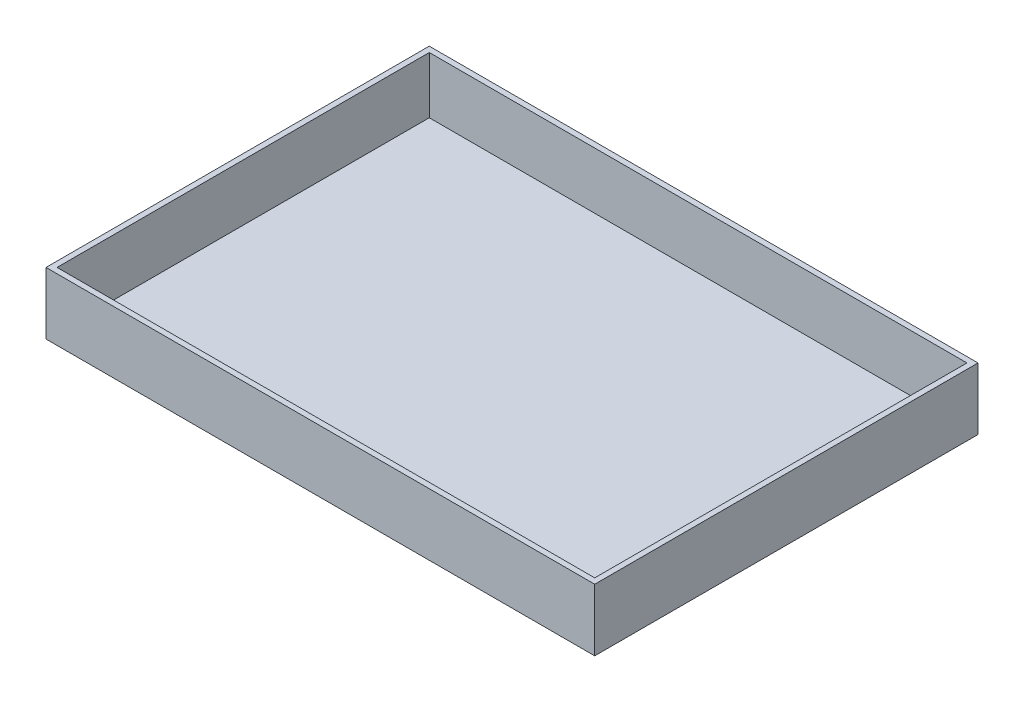
ISO-10303-21;
HEADER;
FILE_DESCRIPTION(('STEP AP214'),'2;1');
FILE_NAME('part.step','',(''),(''),'','','');
FILE_SCHEMA(('AUTOMOTIVE_DESIGN { 1 0 10303 214 1 1 1 1 }'));
ENDSEC;
DATA;
#1=APPLICATION_CONTEXT('core data for automotive mechanical design processes');
#2=APPLICATION_PROTOCOL_DEFINITION('international standard','automotive_design',2000,#1);
#3=PRODUCT_CONTEXT('',#1,'mechanical');
#4=PRODUCT('Part','Part','',(#3));
#5=PRODUCT_RELATED_PRODUCT_CATEGORY('part','',(#4));
#6=PRODUCT_DEFINITION_FORMATION('','',#4);
#7=PRODUCT_DEFINITION_CONTEXT('part definition',#1,'design');
#8=PRODUCT_DEFINITION('design','',#6,#7);
#9=PRODUCT_DEFINITION_SHAPE('','',#8);
#10=(LENGTH_UNIT() NAMED_UNIT(*) SI_UNIT(.MILLI.,.METRE.));
#11=(NAMED_UNIT(*) PLANE_ANGLE_UNIT() SI_UNIT($,.RADIAN.));
#12=(NAMED_UNIT(*) SI_UNIT($,.STERADIAN.) SOLID_ANGLE_UNIT());
#13=UNCERTAINTY_MEASURE_WITH_UNIT(LENGTH_MEASURE(1.E-05),#10,'distance_accuracy_value','');
#14=(GEOMETRIC_REPRESENTATION_CONTEXT(3) GLOBAL_UNCERTAINTY_ASSIGNED_CONTEXT((#13)) GLOBAL_UNIT_ASSIGNED_CONTEXT((#10,
#11,#12)) REPRESENTATION_CONTEXT('',''));
#15=CARTESIAN_POINT('',(0.,0.,0.));
#16=DIRECTION('',(0.,0.,1.));
#17=DIRECTION('',(1.,0.,0.));
#18=AXIS2_PLACEMENT_3D('',#15,#16,#17);
#19=CARTESIAN_POINT('',(0.,28.575,0.));
#20=DIRECTION('',(1.,0.,0.));
#21=DIRECTION('',(0.,0.,-1.));
#22=AXIS2_PLACEMENT_3D('',#19,#20,#21);
#23=PLANE('',#22);
#24=DIRECTION('',(0.,0.,1.));
#25=VECTOR('',#24,1.);
#26=CARTESIAN_POINT('',(0.,0.,0.));
#27=LINE('',#26,#25);
#28=CARTESIAN_POINT('',(0.,0.,0.));
#29=VERTEX_POINT('',#28);
#30=CARTESIAN_POINT('',(0.,0.,176.53));
#31=VERTEX_POINT('',#30);
#32=EDGE_CURVE('E150',#29,#31,#27,.T.);
#33=ORIENTED_EDGE('',*,*,#32,.T.);
#34=DIRECTION('',(0.,-1.,0.));
#35=VECTOR('',#34,1.);
#36=CARTESIAN_POINT('',(0.,28.575,176.53));
#37=LINE('',#36,#35);
#38=CARTESIAN_POINT('',(0.,28.575,176.53));
#39=VERTEX_POINT('',#38);
#40=EDGE_CURVE('E11',#39,#31,#37,.T.);
#41=ORIENTED_EDGE('',*,*,#40,.F.);
#42=DIRECTION('',(0.,0.,1.));
#43=VECTOR('',#42,1.);
#44=CARTESIAN_POINT('',(0.,28.575,0.));
#45=LINE('',#44,#43);
#46=CARTESIAN_POINT('',(0.,28.575,0.));
#47=VERTEX_POINT('',#46);
#48=EDGE_CURVE('E143',#47,#39,#45,.T.);
#49=ORIENTED_EDGE('',*,*,#48,.F.);
#50=DIRECTION('',(0.,-1.,0.));
#51=VECTOR('',#50,1.);
#52=CARTESIAN_POINT('',(0.,28.575,0.));
#53=LINE('',#52,#51);
#54=EDGE_CURVE('E149',#47,#29,#53,.T.);
#55=ORIENTED_EDGE('',*,*,#54,.T.);
#56=EDGE_LOOP('',(#33,#41,#49,#55));
#57=FACE_BOUND('',#56,.T.);
#58=ADVANCED_FACE('F36',(#57),#23,.F.);
#59=CARTESIAN_POINT('',(0.,28.575,176.53));
#60=DIRECTION('',(0.,0.,-1.));
#61=DIRECTION('',(-1.,0.,0.));
#62=AXIS2_PLACEMENT_3D('',#59,#60,#61);
#63=PLANE('',#62);
#64=DIRECTION('',(1.,0.,0.));
#65=VECTOR('',#64,1.);
#66=CARTESIAN_POINT('',(0.,0.,176.53));
#67=LINE('',#66,#65);
#68=CARTESIAN_POINT('',(252.73,0.,176.53));
#69=VERTEX_POINT('',#68);
#70=EDGE_CURVE('E153',#31,#69,#67,.T.);
#71=ORIENTED_EDGE('',*,*,#70,.T.);
#72=DIRECTION('',(0.,-1.,0.));
#73=VECTOR('',#72,1.);
#74=CARTESIAN_POINT('',(252.73,28.575,176.53));
#75=LINE('',#74,#73);
#76=CARTESIAN_POINT('',(252.73,28.575,176.53));
#77=VERTEX_POINT('',#76);
#78=EDGE_CURVE('E43',#77,#69,#75,.T.);
#79=ORIENTED_EDGE('',*,*,#78,.F.);
#80=DIRECTION('',(1.,0.,0.));
#81=VECTOR('',#80,1.);
#82=CARTESIAN_POINT('',(0.,28.575,176.53));
#83=LINE('',#82,#81);
#84=EDGE_CURVE('E87',#39,#77,#83,.T.);
#85=ORIENTED_EDGE('',*,*,#84,.F.);
#86=ORIENTED_EDGE('',*,*,#40,.T.);
#87=EDGE_LOOP('',(#71,#79,#85,#86));
#88=FACE_BOUND('',#87,.T.);
#89=ADVANCED_FACE('F182',(#88),#63,.F.);
#90=CARTESIAN_POINT('',(252.73,28.575,0.));
#91=DIRECTION('',(-1.,0.,0.));
#92=DIRECTION('',(0.,0.,1.));
#93=AXIS2_PLACEMENT_3D('',#90,#91,#92);
#94=PLANE('',#93);
#95=DIRECTION('',(0.,0.,-1.));
#96=VECTOR('',#95,1.);
#97=CARTESIAN_POINT('',(252.73,0.,0.));
#98=LINE('',#97,#96);
#99=CARTESIAN_POINT('',(252.73,0.,0.));
#100=VERTEX_POINT('',#99);
#101=EDGE_CURVE('E155',#69,#100,#98,.T.);
#102=ORIENTED_EDGE('',*,*,#101,.T.);
#103=DIRECTION('',(0.,-1.,0.));
#104=VECTOR('',#103,1.);
#105=CARTESIAN_POINT('',(252.73,28.575,0.));
#106=LINE('',#105,#104);
#107=CARTESIAN_POINT('',(252.73,28.575,0.));
#108=VERTEX_POINT('',#107);
#109=EDGE_CURVE('E159',#108,#100,#106,.T.);
#110=ORIENTED_EDGE('',*,*,#109,.F.);
#111=DIRECTION('',(0.,0.,-1.));
#112=VECTOR('',#111,1.);
#113=CARTESIAN_POINT('',(252.73,28.575,0.));
#114=LINE('',#113,#112);
#115=EDGE_CURVE('E146',#77,#108,#114,.T.);
#116=ORIENTED_EDGE('',*,*,#115,.F.);
#117=ORIENTED_EDGE('',*,*,#78,.T.);
#118=EDGE_LOOP('',(#102,#110,#116,#117));
#119=FACE_BOUND('',#118,.T.);
#120=ADVANCED_FACE('F164',(#119),#94,.F.);
#121=CARTESIAN_POINT('',(0.,28.575,0.));
#122=DIRECTION('',(0.,0.,1.));
#123=DIRECTION('',(1.,0.,0.));
#124=AXIS2_PLACEMENT_3D('',#121,#122,#123);
#125=PLANE('',#124);
#126=DIRECTION('',(-1.,0.,0.));
#127=VECTOR('',#126,1.);
#128=CARTESIAN_POINT('',(0.,0.,0.));
#129=LINE('',#128,#127);
#130=EDGE_CURVE('E80',#100,#29,#129,.T.);
#131=ORIENTED_EDGE('',*,*,#130,.T.);
#132=ORIENTED_EDGE('',*,*,#54,.F.);
#133=DIRECTION('',(-1.,0.,0.));
#134=VECTOR('',#133,1.);
#135=CARTESIAN_POINT('',(0.,28.575,0.));
#136=LINE('',#135,#134);
#137=EDGE_CURVE('E59',#108,#47,#136,.T.);
#138=ORIENTED_EDGE('',*,*,#137,.F.);
#139=ORIENTED_EDGE('',*,*,#109,.T.);
#140=EDGE_LOOP('',(#131,#132,#138,#139));
#141=FACE_BOUND('',#140,.T.);
#142=ADVANCED_FACE('F172',(#141),#125,.F.);
#143=CARTESIAN_POINT('',(0.,28.575,0.));
#144=DIRECTION('',(0.,1.,0.));
#145=DIRECTION('',(0.,0.,1.));
#146=AXIS2_PLACEMENT_3D('',#143,#144,#145);
#147=PLANE('',#146);
#148=DIRECTION('',(0.,0.,1.));
#149=VECTOR('',#148,1.);
#150=CARTESIAN_POINT('',(2.54,28.575,0.));
#151=LINE('',#150,#149);
#152=CARTESIAN_POINT('',(2.54,28.575,2.54));
#153=VERTEX_POINT('',#152);
#154=CARTESIAN_POINT('',(2.54000000000002,28.575,173.99));
#155=VERTEX_POINT('',#154);
#156=EDGE_CURVE('E132',#153,#155,#151,.T.);
#157=ORIENTED_EDGE('',*,*,#156,.F.);
#158=DIRECTION('',(-1.,0.,0.));
#159=VECTOR('',#158,1.);
#160=CARTESIAN_POINT('',(0.,28.575,2.54));
#161=LINE('',#160,#159);
#162=CARTESIAN_POINT('',(250.19,28.575,2.54));
#163=VERTEX_POINT('',#162);
#164=EDGE_CURVE('E141',#163,#153,#161,.T.);
#165=ORIENTED_EDGE('',*,*,#164,.F.);
#166=DIRECTION('',(0.,0.,-1.));
#167=VECTOR('',#166,1.);
#168=CARTESIAN_POINT('',(250.19,28.575,0.));
#169=LINE('',#168,#167);
#170=CARTESIAN_POINT('',(250.19,28.575,173.99));
#171=VERTEX_POINT('',#170);
#172=EDGE_CURVE('E139',#171,#163,#169,.T.);
#173=ORIENTED_EDGE('',*,*,#172,.F.);
#174=DIRECTION('',(1.,0.,0.));
#175=VECTOR('',#174,1.);
#176=CARTESIAN_POINT('',(0.,28.575,173.99));
#177=LINE('',#176,#175);
#178=EDGE_CURVE('E124',#155,#171,#177,.T.);
#179=ORIENTED_EDGE('',*,*,#178,.F.);
#180=EDGE_LOOP('',(#157,#165,#173,#179));
#181=FACE_BOUND('',#180,.T.);
#182=ORIENTED_EDGE('',*,*,#48,.T.);
#183=ORIENTED_EDGE('',*,*,#84,.T.);
#184=ORIENTED_EDGE('',*,*,#115,.T.);
#185=ORIENTED_EDGE('',*,*,#137,.T.);
#186=EDGE_LOOP('',(#182,#183,#184,#185));
#187=FACE_BOUND('',#186,.T.);
#188=ADVANCED_FACE('F174',(#181,#187),#147,.T.);
#189=CARTESIAN_POINT('',(0.,0.,0.));
#190=DIRECTION('',(0.,1.,0.));
#191=DIRECTION('',(0.,0.,1.));
#192=AXIS2_PLACEMENT_3D('',#189,#190,#191);
#193=PLANE('',#192);
#194=ORIENTED_EDGE('',*,*,#32,.F.);
#195=ORIENTED_EDGE('',*,*,#130,.F.);
#196=ORIENTED_EDGE('',*,*,#101,.F.);
#197=ORIENTED_EDGE('',*,*,#70,.F.);
#198=EDGE_LOOP('',(#194,#195,#196,#197));
#199=FACE_BOUND('',#198,.T.);
#200=ADVANCED_FACE('F168',(#199),#193,.F.);
#201=CARTESIAN_POINT('',(2.54,28.575,0.));
#202=DIRECTION('',(1.,0.,0.));
#203=DIRECTION('',(0.,0.,-1.));
#204=AXIS2_PLACEMENT_3D('',#201,#202,#203);
#205=PLANE('',#204);
#206=DIRECTION('',(0.,0.,1.));
#207=VECTOR('',#206,1.);
#208=CARTESIAN_POINT('',(2.54,2.54,0.));
#209=LINE('',#208,#207);
#210=CARTESIAN_POINT('',(2.54,2.54,2.54));
#211=VERTEX_POINT('',#210);
#212=CARTESIAN_POINT('',(2.54000000000002,2.54,173.99));
#213=VERTEX_POINT('',#212);
#214=EDGE_CURVE('E115',#211,#213,#209,.T.);
#215=ORIENTED_EDGE('',*,*,#214,.F.);
#216=DIRECTION('',(0.,-1.,0.));
#217=VECTOR('',#216,1.);
#218=CARTESIAN_POINT('',(2.54,28.575,2.54));
#219=LINE('',#218,#217);
#220=EDGE_CURVE('E135',#153,#211,#219,.T.);
#221=ORIENTED_EDGE('',*,*,#220,.F.);
#222=ORIENTED_EDGE('',*,*,#156,.T.);
#223=DIRECTION('',(0.,-1.,0.));
#224=VECTOR('',#223,1.);
#225=CARTESIAN_POINT('',(2.54000000000002,28.575,173.99));
#226=LINE('',#225,#224);
#227=EDGE_CURVE('E127',#155,#213,#226,.T.);
#228=ORIENTED_EDGE('',*,*,#227,.T.);
#229=EDGE_LOOP('',(#215,#221,#222,#228));
#230=FACE_BOUND('',#229,.T.);
#231=ADVANCED_FACE('F209',(#230),#205,.T.);
#232=CARTESIAN_POINT('',(0.,28.575,173.99));
#233=DIRECTION('',(0.,0.,-1.));
#234=DIRECTION('',(-1.,0.,0.));
#235=AXIS2_PLACEMENT_3D('',#232,#233,#234);
#236=PLANE('',#235);
#237=DIRECTION('',(1.,0.,0.));
#238=VECTOR('',#237,1.);
#239=CARTESIAN_POINT('',(0.,2.54,173.99));
#240=LINE('',#239,#238);
#241=CARTESIAN_POINT('',(250.19,2.54,173.99));
#242=VERTEX_POINT('',#241);
#243=EDGE_CURVE('E109',#213,#242,#240,.T.);
#244=ORIENTED_EDGE('',*,*,#243,.F.);
#245=ORIENTED_EDGE('',*,*,#227,.F.);
#246=ORIENTED_EDGE('',*,*,#178,.T.);
#247=DIRECTION('',(0.,-1.,0.));
#248=VECTOR('',#247,1.);
#249=CARTESIAN_POINT('',(250.19,28.575,173.99));
#250=LINE('',#249,#248);
#251=EDGE_CURVE('E121',#171,#242,#250,.T.);
#252=ORIENTED_EDGE('',*,*,#251,.T.);
#253=EDGE_LOOP('',(#244,#245,#246,#252));
#254=FACE_BOUND('',#253,.T.);
#255=ADVANCED_FACE('F122',(#254),#236,.T.);
#256=CARTESIAN_POINT('',(250.19,28.575,0.));
#257=DIRECTION('',(-1.,0.,0.));
#258=DIRECTION('',(0.,0.,1.));
#259=AXIS2_PLACEMENT_3D('',#256,#257,#258);
#260=PLANE('',#259);
#261=DIRECTION('',(0.,0.,-1.));
#262=VECTOR('',#261,1.);
#263=CARTESIAN_POINT('',(250.19,2.54,0.));
#264=LINE('',#263,#262);
#265=CARTESIAN_POINT('',(250.19,2.54,2.54));
#266=VERTEX_POINT('',#265);
#267=EDGE_CURVE('E113',#242,#266,#264,.T.);
#268=ORIENTED_EDGE('',*,*,#267,.F.);
#269=ORIENTED_EDGE('',*,*,#251,.F.);
#270=ORIENTED_EDGE('',*,*,#172,.T.);
#271=DIRECTION('',(0.,-1.,0.));
#272=VECTOR('',#271,1.);
#273=CARTESIAN_POINT('',(250.19,28.575,2.54));
#274=LINE('',#273,#272);
#275=EDGE_CURVE('E50',#163,#266,#274,.T.);
#276=ORIENTED_EDGE('',*,*,#275,.T.);
#277=EDGE_LOOP('',(#268,#269,#270,#276));
#278=FACE_BOUND('',#277,.T.);
#279=ADVANCED_FACE('F129',(#278),#260,.T.);
#280=CARTESIAN_POINT('',(0.,28.575,2.54));
#281=DIRECTION('',(0.,0.,1.));
#282=DIRECTION('',(1.,0.,0.));
#283=AXIS2_PLACEMENT_3D('',#280,#281,#282);
#284=PLANE('',#283);
#285=DIRECTION('',(-1.,0.,0.));
#286=VECTOR('',#285,1.);
#287=CARTESIAN_POINT('',(0.,2.54,2.54));
#288=LINE('',#287,#286);
#289=EDGE_CURVE('E130',#266,#211,#288,.T.);
#290=ORIENTED_EDGE('',*,*,#289,.F.);
#291=ORIENTED_EDGE('',*,*,#275,.F.);
#292=ORIENTED_EDGE('',*,*,#164,.T.);
#293=ORIENTED_EDGE('',*,*,#220,.T.);
#294=EDGE_LOOP('',(#290,#291,#292,#293));
#295=FACE_BOUND('',#294,.T.);
#296=ADVANCED_FACE('F239',(#295),#284,.T.);
#297=CARTESIAN_POINT('',(0.,2.54,0.));
#298=DIRECTION('',(0.,1.,0.));
#299=DIRECTION('',(0.,0.,1.));
#300=AXIS2_PLACEMENT_3D('',#297,#298,#299);
#301=PLANE('',#300);
#302=ORIENTED_EDGE('',*,*,#214,.T.);
#303=ORIENTED_EDGE('',*,*,#243,.T.);
#304=ORIENTED_EDGE('',*,*,#267,.T.);
#305=ORIENTED_EDGE('',*,*,#289,.T.);
#306=EDGE_LOOP('',(#302,#303,#304,#305));
#307=FACE_BOUND('',#306,.T.);
#308=ADVANCED_FACE('F111',(#307),#301,.T.);
#309=CLOSED_SHELL('',(#58,#89,#120,#142,#188,#200,#231,#255,#279,#296,#308));
#310=MANIFOLD_SOLID_BREP('B2',#309);
#311=ADVANCED_BREP_SHAPE_REPRESENTATION('',(#18,#310),#14);
#312=SHAPE_DEFINITION_REPRESENTATION(#9,#311);
ENDSEC;
END-ISO-10303-21;
